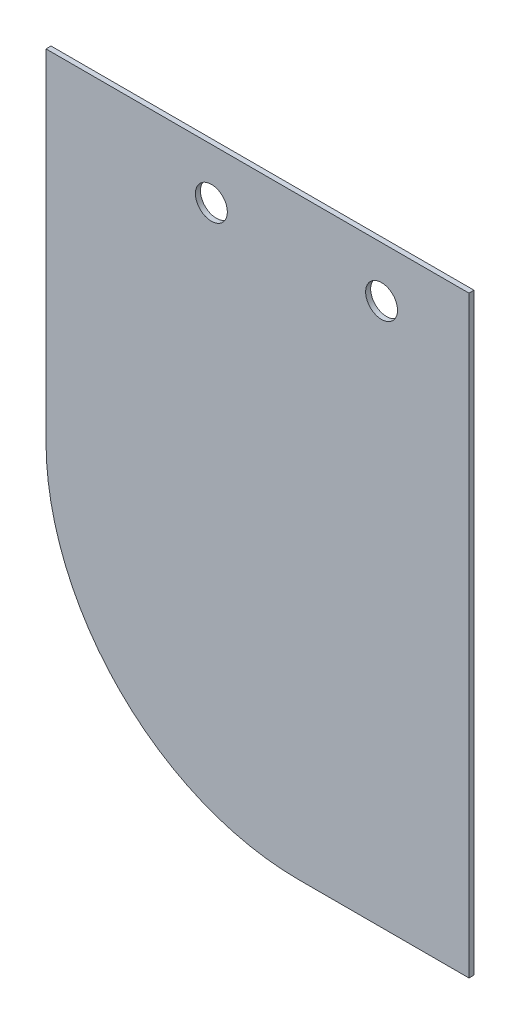
ISO-10303-21;
HEADER;
FILE_DESCRIPTION(('STEP AP214'),'2;1');
FILE_NAME('part.step','',(''),(''),'','','');
FILE_SCHEMA(('AUTOMOTIVE_DESIGN { 1 0 10303 214 1 1 1 1 }'));
ENDSEC;
DATA;
#1=APPLICATION_CONTEXT('core data for automotive mechanical design processes');
#2=APPLICATION_PROTOCOL_DEFINITION('international standard','automotive_design',2000,#1);
#3=PRODUCT_CONTEXT('',#1,'mechanical');
#4=PRODUCT('Part','Part','',(#3));
#5=PRODUCT_RELATED_PRODUCT_CATEGORY('part','',(#4));
#6=PRODUCT_DEFINITION_FORMATION('','',#4);
#7=PRODUCT_DEFINITION_CONTEXT('part definition',#1,'design');
#8=PRODUCT_DEFINITION('design','',#6,#7);
#9=PRODUCT_DEFINITION_SHAPE('','',#8);
#10=(LENGTH_UNIT() NAMED_UNIT(*) SI_UNIT(.MILLI.,.METRE.));
#11=(NAMED_UNIT(*) PLANE_ANGLE_UNIT() SI_UNIT($,.RADIAN.));
#12=(NAMED_UNIT(*) SI_UNIT($,.STERADIAN.) SOLID_ANGLE_UNIT());
#13=UNCERTAINTY_MEASURE_WITH_UNIT(LENGTH_MEASURE(1.E-05),#10,'distance_accuracy_value','');
#14=(GEOMETRIC_REPRESENTATION_CONTEXT(3) GLOBAL_UNCERTAINTY_ASSIGNED_CONTEXT((#13)) GLOBAL_UNIT_ASSIGNED_CONTEXT((#10,
#11,#12)) REPRESENTATION_CONTEXT('',''));
#15=CARTESIAN_POINT('',(0.,0.,0.));
#16=DIRECTION('',(0.,0.,1.));
#17=DIRECTION('',(1.,0.,0.));
#18=AXIS2_PLACEMENT_3D('',#15,#16,#17);
#19=CARTESIAN_POINT('',(-468.975,1066.8,1.5));
#20=DIRECTION('',(0.,0.,1.));
#21=DIRECTION('',(1.,0.,0.));
#22=AXIS2_PLACEMENT_3D('',#19,#20,#21);
#23=PLANE('',#22);
#24=CARTESIAN_POINT('',(-444.2625,1153.3,1.5));
#25=DIRECTION('',(0.,0.,1.));
#26=DIRECTION('',(1.,0.,0.));
#27=AXIS2_PLACEMENT_3D('',#24,#25,#26);
#28=CIRCLE('',#27,4.76250000000003);
#29=CARTESIAN_POINT('',(-439.5,1153.3,1.5));
#30=VERTEX_POINT('',#29);
#31=EDGE_CURVE('E114',#30,#30,#28,.T.);
#32=ORIENTED_EDGE('',*,*,#31,.F.);
#33=EDGE_LOOP('',(#32));
#34=FACE_BOUND('',#33,.T.);
#35=DIRECTION('',(0.,1.,0.));
#36=VECTOR('',#35,1.);
#37=CARTESIAN_POINT('',(-418.175,991.35,1.5));
#38=LINE('',#37,#36);
#39=CARTESIAN_POINT('',(-418.175,991.35,1.5));
#40=VERTEX_POINT('',#39);
#41=CARTESIAN_POINT('',(-418.175,1168.4,1.5));
#42=VERTEX_POINT('',#41);
#43=EDGE_CURVE('E119',#40,#42,#38,.T.);
#44=ORIENTED_EDGE('',*,*,#43,.T.);
#45=DIRECTION('',(-1.,0.,0.));
#46=VECTOR('',#45,1.);
#47=CARTESIAN_POINT('',(-544.425,1168.4,1.5));
#48=LINE('',#47,#46);
#49=CARTESIAN_POINT('',(-544.425,1168.4,1.5));
#50=VERTEX_POINT('',#49);
#51=EDGE_CURVE('E86',#42,#50,#48,.T.);
#52=ORIENTED_EDGE('',*,*,#51,.T.);
#53=DIRECTION('',(0.,-1.,0.));
#54=VECTOR('',#53,1.);
#55=CARTESIAN_POINT('',(-544.425,1066.8,1.5));
#56=LINE('',#55,#54);
#57=CARTESIAN_POINT('',(-544.425,1066.8,1.5));
#58=VERTEX_POINT('',#57);
#59=EDGE_CURVE('E90',#50,#58,#56,.T.);
#60=ORIENTED_EDGE('',*,*,#59,.T.);
#61=CARTESIAN_POINT('',(-468.975,1066.8,1.5));
#62=DIRECTION('',(0.,0.,1.));
#63=DIRECTION('',(1.,0.,0.));
#64=AXIS2_PLACEMENT_3D('',#61,#62,#63);
#65=CIRCLE('',#64,75.45);
#66=CARTESIAN_POINT('',(-468.975,991.35,1.5));
#67=VERTEX_POINT('',#66);
#68=EDGE_CURVE('E94',#58,#67,#65,.T.);
#69=ORIENTED_EDGE('',*,*,#68,.T.);
#70=DIRECTION('',(1.,0.,0.));
#71=VECTOR('',#70,1.);
#72=CARTESIAN_POINT('',(-418.175,991.35,1.5));
#73=LINE('',#72,#71);
#74=EDGE_CURVE('E52',#67,#40,#73,.T.);
#75=ORIENTED_EDGE('',*,*,#74,.T.);
#76=EDGE_LOOP('',(#44,#52,#60,#69,#75));
#77=FACE_BOUND('',#76,.T.);
#78=CARTESIAN_POINT('',(-495.0625,1153.3,1.5));
#79=DIRECTION('',(0.,0.,1.));
#80=DIRECTION('',(1.,0.,0.));
#81=AXIS2_PLACEMENT_3D('',#78,#79,#80);
#82=CIRCLE('',#81,4.76250000000003);
#83=CARTESIAN_POINT('',(-490.3,1153.3,1.5));
#84=VERTEX_POINT('',#83);
#85=EDGE_CURVE('E157',#84,#84,#82,.T.);
#86=ORIENTED_EDGE('',*,*,#85,.F.);
#87=EDGE_LOOP('',(#86));
#88=FACE_BOUND('',#87,.T.);
#89=ADVANCED_FACE('F35',(#34,#77,#88),#23,.T.);
#90=CARTESIAN_POINT('',(-468.975,1066.8,0.));
#91=DIRECTION('',(0.,0.,1.));
#92=DIRECTION('',(1.,0.,0.));
#93=AXIS2_PLACEMENT_3D('',#90,#91,#92);
#94=PLANE('',#93);
#95=CARTESIAN_POINT('',(-444.2625,1153.3,0.));
#96=DIRECTION('',(0.,0.,1.));
#97=DIRECTION('',(1.,0.,0.));
#98=AXIS2_PLACEMENT_3D('',#95,#96,#97);
#99=CIRCLE('',#98,4.76250000000003);
#100=CARTESIAN_POINT('',(-439.5,1153.3,0.));
#101=VERTEX_POINT('',#100);
#102=EDGE_CURVE('E162',#101,#101,#99,.T.);
#103=ORIENTED_EDGE('',*,*,#102,.T.);
#104=EDGE_LOOP('',(#103));
#105=FACE_BOUND('',#104,.T.);
#106=DIRECTION('',(0.,1.,0.));
#107=VECTOR('',#106,1.);
#108=CARTESIAN_POINT('',(-418.175,991.35,0.));
#109=LINE('',#108,#107);
#110=CARTESIAN_POINT('',(-418.175,991.35,0.));
#111=VERTEX_POINT('',#110);
#112=CARTESIAN_POINT('',(-418.175,1168.4,0.));
#113=VERTEX_POINT('',#112);
#114=EDGE_CURVE('E110',#111,#113,#109,.T.);
#115=ORIENTED_EDGE('',*,*,#114,.F.);
#116=DIRECTION('',(1.,0.,0.));
#117=VECTOR('',#116,1.);
#118=CARTESIAN_POINT('',(-418.175,991.35,0.));
#119=LINE('',#118,#117);
#120=CARTESIAN_POINT('',(-468.975,991.35,0.));
#121=VERTEX_POINT('',#120);
#122=EDGE_CURVE('E78',#121,#111,#119,.T.);
#123=ORIENTED_EDGE('',*,*,#122,.F.);
#124=CARTESIAN_POINT('',(-468.975,1066.8,0.));
#125=DIRECTION('',(0.,0.,1.));
#126=DIRECTION('',(1.,0.,0.));
#127=AXIS2_PLACEMENT_3D('',#124,#125,#126);
#128=CIRCLE('',#127,75.45);
#129=CARTESIAN_POINT('',(-544.425,1066.8,0.));
#130=VERTEX_POINT('',#129);
#131=EDGE_CURVE('E72',#130,#121,#128,.T.);
#132=ORIENTED_EDGE('',*,*,#131,.F.);
#133=DIRECTION('',(0.,-1.,0.));
#134=VECTOR('',#133,1.);
#135=CARTESIAN_POINT('',(-544.425,1066.8,0.));
#136=LINE('',#135,#134);
#137=CARTESIAN_POINT('',(-544.425,1168.4,0.));
#138=VERTEX_POINT('',#137);
#139=EDGE_CURVE('E101',#138,#130,#136,.T.);
#140=ORIENTED_EDGE('',*,*,#139,.F.);
#141=DIRECTION('',(-1.,0.,0.));
#142=VECTOR('',#141,1.);
#143=CARTESIAN_POINT('',(-544.425,1168.4,0.));
#144=LINE('',#143,#142);
#145=EDGE_CURVE('E113',#113,#138,#144,.T.);
#146=ORIENTED_EDGE('',*,*,#145,.F.);
#147=EDGE_LOOP('',(#115,#123,#132,#140,#146));
#148=FACE_BOUND('',#147,.T.);
#149=CARTESIAN_POINT('',(-495.0625,1153.3,0.));
#150=DIRECTION('',(0.,0.,1.));
#151=DIRECTION('',(1.,0.,0.));
#152=AXIS2_PLACEMENT_3D('',#149,#150,#151);
#153=CIRCLE('',#152,4.76250000000003);
#154=CARTESIAN_POINT('',(-490.3,1153.3,0.));
#155=VERTEX_POINT('',#154);
#156=EDGE_CURVE('E160',#155,#155,#153,.T.);
#157=ORIENTED_EDGE('',*,*,#156,.T.);
#158=EDGE_LOOP('',(#157));
#159=FACE_BOUND('',#158,.T.);
#160=ADVANCED_FACE('F123',(#105,#148,#159),#94,.F.);
#161=CARTESIAN_POINT('',(-418.175,991.35,1.5));
#162=DIRECTION('',(-1.,0.,0.));
#163=DIRECTION('',(0.,0.,1.));
#164=AXIS2_PLACEMENT_3D('',#161,#162,#163);
#165=PLANE('',#164);
#166=ORIENTED_EDGE('',*,*,#114,.T.);
#167=DIRECTION('',(0.,0.,-1.));
#168=VECTOR('',#167,1.);
#169=CARTESIAN_POINT('',(-418.175,1168.4,1.5));
#170=LINE('',#169,#168);
#171=EDGE_CURVE('E11',#42,#113,#170,.T.);
#172=ORIENTED_EDGE('',*,*,#171,.F.);
#173=ORIENTED_EDGE('',*,*,#43,.F.);
#174=DIRECTION('',(0.,0.,-1.));
#175=VECTOR('',#174,1.);
#176=CARTESIAN_POINT('',(-418.175,991.35,1.5));
#177=LINE('',#176,#175);
#178=EDGE_CURVE('E106',#40,#111,#177,.T.);
#179=ORIENTED_EDGE('',*,*,#178,.T.);
#180=EDGE_LOOP('',(#166,#172,#173,#179));
#181=FACE_BOUND('',#180,.T.);
#182=ADVANCED_FACE('F37',(#181),#165,.F.);
#183=CARTESIAN_POINT('',(-544.425,1168.4,1.5));
#184=DIRECTION('',(0.,-1.,0.));
#185=DIRECTION('',(0.,0.,-1.));
#186=AXIS2_PLACEMENT_3D('',#183,#184,#185);
#187=PLANE('',#186);
#188=ORIENTED_EDGE('',*,*,#145,.T.);
#189=DIRECTION('',(0.,0.,-1.));
#190=VECTOR('',#189,1.);
#191=CARTESIAN_POINT('',(-544.425,1168.4,1.5));
#192=LINE('',#191,#190);
#193=EDGE_CURVE('E44',#50,#138,#192,.T.);
#194=ORIENTED_EDGE('',*,*,#193,.F.);
#195=ORIENTED_EDGE('',*,*,#51,.F.);
#196=ORIENTED_EDGE('',*,*,#171,.T.);
#197=EDGE_LOOP('',(#188,#194,#195,#196));
#198=FACE_BOUND('',#197,.T.);
#199=ADVANCED_FACE('F194',(#198),#187,.F.);
#200=CARTESIAN_POINT('',(-544.425,1066.8,1.5));
#201=DIRECTION('',(1.,0.,0.));
#202=DIRECTION('',(0.,0.,-1.));
#203=AXIS2_PLACEMENT_3D('',#200,#201,#202);
#204=PLANE('',#203);
#205=ORIENTED_EDGE('',*,*,#139,.T.);
#206=DIRECTION('',(0.,0.,-1.));
#207=VECTOR('',#206,1.);
#208=CARTESIAN_POINT('',(-544.425,1066.8,1.5));
#209=LINE('',#208,#207);
#210=EDGE_CURVE('E98',#58,#130,#209,.T.);
#211=ORIENTED_EDGE('',*,*,#210,.F.);
#212=ORIENTED_EDGE('',*,*,#59,.F.);
#213=ORIENTED_EDGE('',*,*,#193,.T.);
#214=EDGE_LOOP('',(#205,#211,#212,#213));
#215=FACE_BOUND('',#214,.T.);
#216=ADVANCED_FACE('F99',(#215),#204,.F.);
#217=CARTESIAN_POINT('',(-468.975,1066.8,1.5));
#218=DIRECTION('',(0.,0.,-1.));
#219=DIRECTION('',(-1.,0.,0.));
#220=AXIS2_PLACEMENT_3D('',#217,#218,#219);
#221=CYLINDRICAL_SURFACE('',#220,75.45);
#222=ORIENTED_EDGE('',*,*,#131,.T.);
#223=DIRECTION('',(0.,0.,-1.));
#224=VECTOR('',#223,1.);
#225=CARTESIAN_POINT('',(-468.975,991.35,1.5));
#226=LINE('',#225,#224);
#227=EDGE_CURVE('E102',#67,#121,#226,.T.);
#228=ORIENTED_EDGE('',*,*,#227,.F.);
#229=ORIENTED_EDGE('',*,*,#68,.F.);
#230=ORIENTED_EDGE('',*,*,#210,.T.);
#231=EDGE_LOOP('',(#222,#228,#229,#230));
#232=FACE_BOUND('',#231,.T.);
#233=ADVANCED_FACE('F104',(#232),#221,.T.);
#234=CARTESIAN_POINT('',(-418.175,991.35,1.5));
#235=DIRECTION('',(0.,1.,0.));
#236=DIRECTION('',(0.,0.,1.));
#237=AXIS2_PLACEMENT_3D('',#234,#235,#236);
#238=PLANE('',#237);
#239=ORIENTED_EDGE('',*,*,#122,.T.);
#240=ORIENTED_EDGE('',*,*,#178,.F.);
#241=ORIENTED_EDGE('',*,*,#74,.F.);
#242=ORIENTED_EDGE('',*,*,#227,.T.);
#243=EDGE_LOOP('',(#239,#240,#241,#242));
#244=FACE_BOUND('',#243,.T.);
#245=ADVANCED_FACE('F128',(#244),#238,.F.);
#246=CARTESIAN_POINT('',(-444.2625,1153.3,1.5));
#247=DIRECTION('',(0.,0.,-1.));
#248=DIRECTION('',(-1.,0.,0.));
#249=AXIS2_PLACEMENT_3D('',#246,#247,#248);
#250=CYLINDRICAL_SURFACE('',#249,4.76250000000003);
#251=ORIENTED_EDGE('',*,*,#31,.T.);
#252=EDGE_LOOP('',(#251));
#253=FACE_BOUND('',#252,.T.);
#254=ORIENTED_EDGE('',*,*,#102,.F.);
#255=EDGE_LOOP('',(#254));
#256=FACE_BOUND('',#255,.T.);
#257=ADVANCED_FACE('F130',(#253,#256),#250,.F.);
#258=CARTESIAN_POINT('',(-495.0625,1153.3,1.5));
#259=DIRECTION('',(0.,0.,-1.));
#260=DIRECTION('',(-1.,0.,0.));
#261=AXIS2_PLACEMENT_3D('',#258,#259,#260);
#262=CYLINDRICAL_SURFACE('',#261,4.76250000000003);
#263=ORIENTED_EDGE('',*,*,#85,.T.);
#264=EDGE_LOOP('',(#263));
#265=FACE_BOUND('',#264,.T.);
#266=ORIENTED_EDGE('',*,*,#156,.F.);
#267=EDGE_LOOP('',(#266));
#268=FACE_BOUND('',#267,.T.);
#269=ADVANCED_FACE('F136',(#265,#268),#262,.F.);
#270=CLOSED_SHELL('',(#89,#160,#182,#199,#216,#233,#245,#257,#269));
#271=MANIFOLD_SOLID_BREP('B2',#270);
#272=ADVANCED_BREP_SHAPE_REPRESENTATION('',(#18,#271),#14);
#273=SHAPE_DEFINITION_REPRESENTATION(#9,#272);
ENDSEC;
END-ISO-10303-21;
